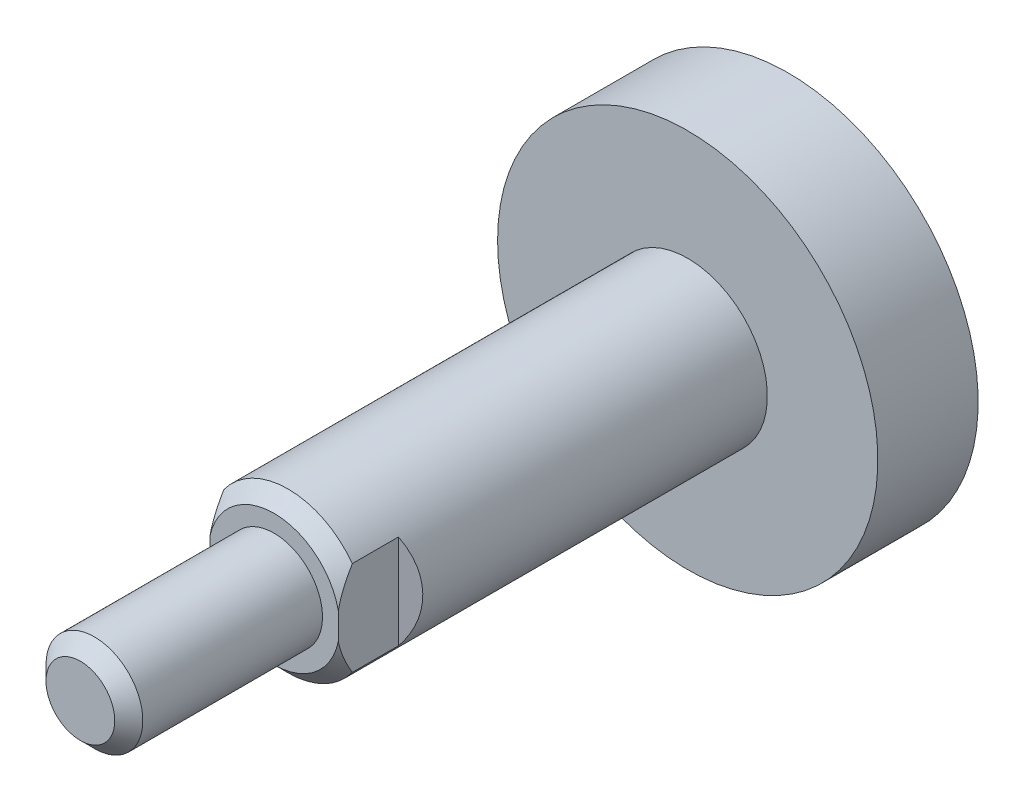
ISO-10303-21;
HEADER;
FILE_DESCRIPTION(('STEP AP214'),'2;1');
FILE_NAME('part.step','',(''),(''),'','','');
FILE_SCHEMA(('AUTOMOTIVE_DESIGN { 1 0 10303 214 1 1 1 1 }'));
ENDSEC;
DATA;
#1=APPLICATION_CONTEXT('core data for automotive mechanical design processes');
#2=APPLICATION_PROTOCOL_DEFINITION('international standard','automotive_design',2000,#1);
#3=PRODUCT_CONTEXT('',#1,'mechanical');
#4=PRODUCT('Part','Part','',(#3));
#5=PRODUCT_RELATED_PRODUCT_CATEGORY('part','',(#4));
#6=PRODUCT_DEFINITION_FORMATION('','',#4);
#7=PRODUCT_DEFINITION_CONTEXT('part definition',#1,'design');
#8=PRODUCT_DEFINITION('design','',#6,#7);
#9=PRODUCT_DEFINITION_SHAPE('','',#8);
#10=(LENGTH_UNIT() NAMED_UNIT(*) SI_UNIT(.MILLI.,.METRE.));
#11=(NAMED_UNIT(*) PLANE_ANGLE_UNIT() SI_UNIT($,.RADIAN.));
#12=(NAMED_UNIT(*) SI_UNIT($,.STERADIAN.) SOLID_ANGLE_UNIT());
#13=UNCERTAINTY_MEASURE_WITH_UNIT(LENGTH_MEASURE(1.E-05),#10,'distance_accuracy_value','');
#14=(GEOMETRIC_REPRESENTATION_CONTEXT(3) GLOBAL_UNCERTAINTY_ASSIGNED_CONTEXT((#13)) GLOBAL_UNIT_ASSIGNED_CONTEXT((#10,
#11,#12)) REPRESENTATION_CONTEXT('',''));
#15=CARTESIAN_POINT('',(0.,0.,0.));
#16=DIRECTION('',(0.,0.,1.));
#17=DIRECTION('',(1.,0.,0.));
#18=AXIS2_PLACEMENT_3D('',#15,#16,#17);
#19=CARTESIAN_POINT('',(0.,0.,35.266));
#20=DIRECTION('',(0.,0.,1.));
#21=DIRECTION('',(1.,0.,0.));
#22=AXIS2_PLACEMENT_3D('',#19,#20,#21);
#23=PLANE('',#22);
#24=CARTESIAN_POINT('',(0.,0.,35.2659999999219));
#25=DIRECTION('',(0.,0.,-1.));
#26=DIRECTION('',(-1.,0.,0.));
#27=AXIS2_PLACEMENT_3D('',#24,#25,#26);
#28=CIRCLE('',#27,1.71299999999519);
#29=CARTESIAN_POINT('',(-1.71299999999519,0.,35.2659999999219));
#30=VERTEX_POINT('',#29);
#31=EDGE_CURVE('E20',#30,#30,#28,.T.);
#32=ORIENTED_EDGE('',*,*,#31,.F.);
#33=EDGE_LOOP('',(#32));
#34=FACE_BOUND('',#33,.T.);
#35=ADVANCED_FACE('F17',(#34),#23,.T.);
#36=CARTESIAN_POINT('',(0.,0.,34.5659999999839));
#37=DIRECTION('',(0.,0.,-1.));
#38=DIRECTION('',(-1.,0.,0.));
#39=AXIS2_PLACEMENT_3D('',#36,#37,#38);
#40=CONICAL_SURFACE('',#39,2.41299999993316,0.785398163397448);
#41=ORIENTED_EDGE('',*,*,#31,.T.);
#42=EDGE_LOOP('',(#41));
#43=FACE_BOUND('',#42,.T.);
#44=CARTESIAN_POINT('',(0.,0.,34.566));
#45=DIRECTION('',(0.,0.,-1.));
#46=DIRECTION('',(-1.,0.,0.));
#47=AXIS2_PLACEMENT_3D('',#44,#45,#46);
#48=CIRCLE('',#47,2.413);
#49=CARTESIAN_POINT('',(-2.413,0.,34.566));
#50=VERTEX_POINT('',#49);
#51=EDGE_CURVE('E72',#50,#50,#48,.T.);
#52=ORIENTED_EDGE('',*,*,#51,.F.);
#53=EDGE_LOOP('',(#52));
#54=FACE_BOUND('',#53,.T.);
#55=ADVANCED_FACE('F197',(#43,#54),#40,.T.);
#56=CARTESIAN_POINT('',(0.,0.,35.266));
#57=DIRECTION('',(0.,0.,-1.));
#58=DIRECTION('',(-1.,0.,0.));
#59=AXIS2_PLACEMENT_3D('',#56,#57,#58);
#60=CYLINDRICAL_SURFACE('',#59,2.413);
#61=ORIENTED_EDGE('',*,*,#51,.T.);
#62=EDGE_LOOP('',(#61));
#63=FACE_BOUND('',#62,.T.);
#64=CARTESIAN_POINT('',(0.,0.,25.614));
#65=DIRECTION('',(0.,0.,-1.));
#66=DIRECTION('',(-1.,0.,0.));
#67=AXIS2_PLACEMENT_3D('',#64,#65,#66);
#68=CIRCLE('',#67,2.413);
#69=CARTESIAN_POINT('',(-2.413,0.,25.614));
#70=VERTEX_POINT('',#69);
#71=EDGE_CURVE('E71',#70,#70,#68,.F.);
#72=ORIENTED_EDGE('',*,*,#71,.T.);
#73=EDGE_LOOP('',(#72));
#74=FACE_BOUND('',#73,.T.);
#75=ADVANCED_FACE('F204',(#63,#74),#60,.T.);
#76=CARTESIAN_POINT('',(0.,0.,25.614));
#77=DIRECTION('',(0.,0.,-1.));
#78=DIRECTION('',(0.,1.,0.));
#79=AXIS2_PLACEMENT_3D('',#76,#77,#78);
#80=PLANE('',#79);
#81=ORIENTED_EDGE('',*,*,#71,.F.);
#82=EDGE_LOOP('',(#81));
#83=FACE_BOUND('',#82,.T.);
#84=DIRECTION('',(0.,1.,0.));
#85=VECTOR('',#84,1.);
#86=CARTESIAN_POINT('',(3.2,0.,25.614));
#87=LINE('',#86,#85);
#88=CARTESIAN_POINT('',(3.2,0.668102537170797,25.6139999999809));
#89=VERTEX_POINT('',#88);
#90=CARTESIAN_POINT('',(3.2,-0.668102537170798,25.6139999999809));
#91=VERTEX_POINT('',#90);
#92=EDGE_CURVE('E59',#89,#91,#87,.F.);
#93=ORIENTED_EDGE('',*,*,#92,.F.);
#94=CARTESIAN_POINT('',(0.,0.,25.6139999999618));
#95=DIRECTION('',(0.,0.,-1.));
#96=DIRECTION('',(0.,1.,0.));
#97=AXIS2_PLACEMENT_3D('',#94,#95,#96);
#98=CIRCLE('',#97,3.26900000004571);
#99=CARTESIAN_POINT('',(-3.2,0.668102537155263,25.6139999999841));
#100=VERTEX_POINT('',#99);
#101=EDGE_CURVE('E92',#100,#89,#98,.T.);
#102=ORIENTED_EDGE('',*,*,#101,.F.);
#103=DIRECTION('',(0.,1.,0.));
#104=VECTOR('',#103,1.);
#105=CARTESIAN_POINT('',(-3.2,-9.475,25.614));
#106=LINE('',#105,#104);
#107=CARTESIAN_POINT('',(-3.2,-0.668102537154732,25.6139999999842));
#108=VERTEX_POINT('',#107);
#109=EDGE_CURVE('E78',#100,#108,#106,.F.);
#110=ORIENTED_EDGE('',*,*,#109,.T.);
#111=CARTESIAN_POINT('',(0.,0.,25.6139999999618));
#112=DIRECTION('',(0.,0.,-1.));
#113=DIRECTION('',(0.,1.,0.));
#114=AXIS2_PLACEMENT_3D('',#111,#112,#113);
#115=CIRCLE('',#114,3.26900000004571);
#116=EDGE_CURVE('E76',#91,#108,#115,.T.);
#117=ORIENTED_EDGE('',*,*,#116,.F.);
#118=EDGE_LOOP('',(#93,#102,#110,#117));
#119=FACE_BOUND('',#118,.T.);
#120=ADVANCED_FACE('F77',(#83,#119),#80,.F.);
#121=CARTESIAN_POINT('',(0.,0.,24.9140000000807));
#122=DIRECTION('',(0.,0.,-1.));
#123=DIRECTION('',(0.,1.,0.));
#124=AXIS2_PLACEMENT_3D('',#121,#122,#123);
#125=CONICAL_SURFACE('',#124,3.96899999998368,0.785398163438051);
#126=CARTESIAN_POINT('',(-3.20000000000324,-0.668102537045559,25.6140000000079));
#127=CARTESIAN_POINT('',(-3.20000000000116,-0.791923989307162,25.5887118948215));
#128=CARTESIAN_POINT('',(-3.20000000000031,-0.914214432197644,25.5569533814339));
#129=CARTESIAN_POINT('',(-3.19999999999969,-1.15522323067472,25.482786734809));
#130=CARTESIAN_POINT('',(-3.19999999999992,-1.27394966585461,25.440405109426));
#131=CARTESIAN_POINT('',(-3.20000000000008,-1.50692397331803,25.3475394481742));
#132=CARTESIAN_POINT('',(-3.20000000000002,-1.62120166838874,25.2971285477279));
#133=CARTESIAN_POINT('',(-3.19999999999998,-1.8466563464418,25.1897204575799));
#134=CARTESIAN_POINT('',(-3.2,-1.95783200288132,25.1327205021669));
#135=CARTESIAN_POINT('',(-3.2,-2.1147772258552,25.047544782855));
#136=CARTESIAN_POINT('',(-3.2,-2.161701362435,25.021462011141));
#137=CARTESIAN_POINT('',(-3.2,-2.25515024754835,24.9683835316909));
#138=CARTESIAN_POINT('',(-3.2,-2.30167405357722,24.9413861634868));
#139=CARTESIAN_POINT('',(-3.2,-2.34796954838271,24.9140000000477));
#140=B_SPLINE_CURVE_WITH_KNOTS('',3,(#126,#127,#128,#129,#130,#131,#132,#133,#134,#135,#136,
#137,#138,#139),.UNSPECIFIED.,.F.,.F.,(4,2,2,2,2,2,4),(0.,0.378663318923574,0.756391005243895,
1.13085654278463,1.50547983437227,1.66653163363144,1.82789340191547),.UNSPECIFIED.);
#141=CARTESIAN_POINT('',(-3.2,-2.3479695483686,24.9140000000238));
#142=VERTEX_POINT('',#141);
#143=EDGE_CURVE('E117',#108,#142,#140,.T.);
#144=ORIENTED_EDGE('',*,*,#143,.T.);
#145=CARTESIAN_POINT('',(0.,0.,24.914));
#146=DIRECTION('',(0.,0.,-1.));
#147=DIRECTION('',(-1.,0.,0.));
#148=AXIS2_PLACEMENT_3D('',#145,#146,#147);
#149=CIRCLE('',#148,3.969);
#150=CARTESIAN_POINT('',(3.2,-2.3479695483686,24.9140000000238));
#151=VERTEX_POINT('',#150);
#152=EDGE_CURVE('E86',#151,#142,#149,.T.);
#153=ORIENTED_EDGE('',*,*,#152,.F.);
#154=CARTESIAN_POINT('',(3.2,-2.34796954838271,24.9140000000477));
#155=CARTESIAN_POINT('',(3.2,-2.28227540638902,24.9528576848915));
#156=CARTESIAN_POINT('',(3.2,-2.21612013329714,24.9909397042438));
#157=CARTESIAN_POINT('',(3.2,-2.08277615458881,25.065293160087));
#158=CARTESIAN_POINT('',(3.2,-2.01558715530726,25.1015640691656));
#159=CARTESIAN_POINT('',(3.2,-1.81330543751406,25.2067462963586));
#160=CARTESIAN_POINT('',(3.2,-1.6765834937986,25.2725768397312));
#161=CARTESIAN_POINT('',(3.2,-1.39788707534561,25.3932563066866));
#162=CARTESIAN_POINT('',(3.2,-1.25590184064602,25.4480810761872));
#163=CARTESIAN_POINT('',(3.2,-0.966123687795267,25.5431571719073));
#164=CARTESIAN_POINT('',(3.2,-0.81829778980787,25.5833066541209));
#165=CARTESIAN_POINT('',(3.2,-0.668102537044839,25.6140000000067));
#166=B_SPLINE_CURVE_WITH_KNOTS('',3,(#154,#155,#156,#157,#158,#159,#160,#161,#162,#163,#164,
#165),.UNSPECIFIED.,.F.,.F.,(4,2,2,2,2,4),(0.,0.228972156487963,0.458010607517393,
0.91289148643811,1.36876002116686,1.82773469580556),.UNSPECIFIED.);
#167=EDGE_CURVE('E64',#151,#91,#166,.T.);
#168=ORIENTED_EDGE('',*,*,#167,.T.);
#169=ORIENTED_EDGE('',*,*,#116,.T.);
#170=EDGE_LOOP('',(#144,#153,#168,#169));
#171=FACE_BOUND('',#170,.T.);
#172=ADVANCED_FACE('F85',(#171),#125,.T.);
#173=CARTESIAN_POINT('',(3.2,-9.475,22.614));
#174=DIRECTION('',(-0.500000000000005,0.,-0.866025403784436));
#175=DIRECTION('',(-0.866025403784436,0.,0.500000000000005));
#176=AXIS2_PLACEMENT_3D('',#173,#174,#175);
#177=PLANE('',#176);
#178=CARTESIAN_POINT('',(0.,0.,24.4615208614068));
#179=DIRECTION('',(-0.500000000000005,0.,-0.866025403784436));
#180=DIRECTION('',(0.866025403784436,0.,-0.500000000000005));
#181=AXIS2_PLACEMENT_3D('',#178,#179,#180);
#182=ELLIPSE('',#181,4.58300643682726,3.969);
#183=CARTESIAN_POINT('',(3.2,2.34796954835449,22.614));
#184=VERTEX_POINT('',#183);
#185=CARTESIAN_POINT('',(3.2,-2.34796954835449,22.614));
#186=VERTEX_POINT('',#185);
#187=EDGE_CURVE('E176',#184,#186,#182,.T.);
#188=ORIENTED_EDGE('',*,*,#187,.F.);
#189=DIRECTION('',(0.,1.,0.));
#190=VECTOR('',#189,1.);
#191=CARTESIAN_POINT('',(3.2,-9.475,22.614));
#192=LINE('',#191,#190);
#193=EDGE_CURVE('E87',#184,#186,#192,.F.);
#194=ORIENTED_EDGE('',*,*,#193,.T.);
#195=EDGE_LOOP('',(#188,#194));
#196=FACE_BOUND('',#195,.T.);
#197=ADVANCED_FACE('F112',(#196),#177,.F.);
#198=CARTESIAN_POINT('',(-3.2,-9.475,22.614));
#199=DIRECTION('',(0.500000000000004,0.,-0.866025403784436));
#200=DIRECTION('',(-0.866025403784436,0.,-0.500000000000004));
#201=AXIS2_PLACEMENT_3D('',#198,#199,#200);
#202=PLANE('',#201);
#203=CARTESIAN_POINT('',(0.,0.,24.4615208614068));
#204=DIRECTION('',(0.500000000000004,0.,-0.866025403784436));
#205=DIRECTION('',(-0.866025403784436,0.,-0.500000000000004));
#206=AXIS2_PLACEMENT_3D('',#203,#204,#205);
#207=ELLIPSE('',#206,4.58300643682726,3.969);
#208=CARTESIAN_POINT('',(-3.2,-2.34796954835449,22.614));
#209=VERTEX_POINT('',#208);
#210=CARTESIAN_POINT('',(-3.2,2.34796954835449,22.614));
#211=VERTEX_POINT('',#210);
#212=EDGE_CURVE('E173',#209,#211,#207,.T.);
#213=ORIENTED_EDGE('',*,*,#212,.F.);
#214=DIRECTION('',(0.,1.,0.));
#215=VECTOR('',#214,1.);
#216=CARTESIAN_POINT('',(-3.2,-9.475,22.614));
#217=LINE('',#216,#215);
#218=EDGE_CURVE('E82',#209,#211,#217,.T.);
#219=ORIENTED_EDGE('',*,*,#218,.T.);
#220=EDGE_LOOP('',(#213,#219));
#221=FACE_BOUND('',#220,.T.);
#222=ADVANCED_FACE('F130',(#221),#202,.F.);
#223=CARTESIAN_POINT('',(-3.2,-9.475,25.614));
#224=DIRECTION('',(1.,0.,0.));
#225=DIRECTION('',(0.,0.,-1.));
#226=AXIS2_PLACEMENT_3D('',#223,#224,#225);
#227=PLANE('',#226);
#228=ORIENTED_EDGE('',*,*,#143,.F.);
#229=ORIENTED_EDGE('',*,*,#109,.F.);
#230=CARTESIAN_POINT('',(-3.19999999998987,2.34796954838807,24.9140000000384));
#231=CARTESIAN_POINT('',(-3.19999999999627,2.28227540639574,24.9528576848853));
#232=CARTESIAN_POINT('',(-3.19999999999898,2.21612013330425,24.9909397042391));
#233=CARTESIAN_POINT('',(-3.20000000000102,2.08277615459583,25.0652931600838));
#234=CARTESIAN_POINT('',(-3.20000000000036,2.01558715531381,25.1015640691624));
#235=CARTESIAN_POINT('',(-3.19999999999929,1.81330543751945,25.2067462963555));
#236=CARTESIAN_POINT('',(-3.1999999999998,1.67658349380355,25.2725768397288));
#237=CARTESIAN_POINT('',(-3.2000000000002,1.39788707534955,25.3932563066852));
#238=CARTESIAN_POINT('',(-3.2000000000001,1.2559018406494,25.4480810761861));
#239=CARTESIAN_POINT('',(-3.1999999999999,0.966123687797418,25.5431571719066));
#240=CARTESIAN_POINT('',(-3.19999999999979,0.818297789809342,25.5833066541205));
#241=CARTESIAN_POINT('',(-3.2,0.668102537045687,25.6140000000065));
#242=B_SPLINE_CURVE_WITH_KNOTS('',3,(#230,#231,#232,#233,#234,#235,#236,#237,#238,#239,#240,
#241),.UNSPECIFIED.,.F.,.F.,(4,2,2,2,2,4),(0.,0.228972156489184,0.458010607519769,
0.912891486442607,1.3687600211732,1.82773469581398),.UNSPECIFIED.);
#243=CARTESIAN_POINT('',(-3.2,2.34796954835449,24.9140000000322));
#244=VERTEX_POINT('',#243);
#245=EDGE_CURVE('E122',#244,#100,#242,.T.);
#246=ORIENTED_EDGE('',*,*,#245,.F.);
#247=DIRECTION('',(0.,0.,-1.));
#248=VECTOR('',#247,1.);
#249=CARTESIAN_POINT('',(-3.2,2.34796954835449,36.8400272581176));
#250=LINE('',#249,#248);
#251=EDGE_CURVE('E175',#211,#244,#250,.F.);
#252=ORIENTED_EDGE('',*,*,#251,.F.);
#253=ORIENTED_EDGE('',*,*,#218,.F.);
#254=DIRECTION('',(0.,0.,-1.));
#255=VECTOR('',#254,1.);
#256=CARTESIAN_POINT('',(-3.2,-2.34796954835449,36.8400272581176));
#257=LINE('',#256,#255);
#258=EDGE_CURVE('E178',#142,#209,#257,.T.);
#259=ORIENTED_EDGE('',*,*,#258,.F.);
#260=EDGE_LOOP('',(#228,#229,#246,#252,#253,#259));
#261=FACE_BOUND('',#260,.T.);
#262=ADVANCED_FACE('F126',(#261),#227,.F.);
#263=CARTESIAN_POINT('',(0.,0.,24.9140000000807));
#264=DIRECTION('',(0.,0.,-1.));
#265=DIRECTION('',(0.,1.,0.));
#266=AXIS2_PLACEMENT_3D('',#263,#264,#265);
#267=CONICAL_SURFACE('',#266,3.96899999998368,0.785398163438051);
#268=ORIENTED_EDGE('',*,*,#245,.T.);
#269=ORIENTED_EDGE('',*,*,#101,.T.);
#270=CARTESIAN_POINT('',(3.20000000000325,0.668102537045564,25.6140000000079));
#271=CARTESIAN_POINT('',(3.20000000000117,0.791923989307168,25.5887118948215));
#272=CARTESIAN_POINT('',(3.20000000000031,0.914214432197651,25.5569533814339));
#273=CARTESIAN_POINT('',(3.19999999999969,1.15522323067473,25.482786734809));
#274=CARTESIAN_POINT('',(3.19999999999992,1.27394966585462,25.440405109426));
#275=CARTESIAN_POINT('',(3.20000000000008,1.50692397331804,25.3475394481742));
#276=CARTESIAN_POINT('',(3.20000000000003,1.62120166838875,25.2971285477279));
#277=CARTESIAN_POINT('',(3.19999999999998,1.84665634644181,25.1897204575799));
#278=CARTESIAN_POINT('',(3.2,1.95783200288133,25.1327205021669));
#279=CARTESIAN_POINT('',(3.20000000000001,2.11477722585521,25.0475447828549));
#280=CARTESIAN_POINT('',(3.2,2.161701362435,25.021462011141));
#281=CARTESIAN_POINT('',(3.2,2.25515024754835,24.9683835316909));
#282=CARTESIAN_POINT('',(3.2,2.30167405357722,24.9413861634868));
#283=CARTESIAN_POINT('',(3.2,2.34796954838271,24.9140000000477));
#284=B_SPLINE_CURVE_WITH_KNOTS('',3,(#270,#271,#272,#273,#274,#275,#276,#277,#278,#279,#280,
#281,#282,#283),.UNSPECIFIED.,.F.,.F.,(4,2,2,2,2,2,4),(0.,0.378663318923575,0.756391005243901,
1.13085654278463,1.50547983437227,1.66653163363144,1.82789340191546),.UNSPECIFIED.);
#285=CARTESIAN_POINT('',(3.2,2.3479695483686,24.9140000000238));
#286=VERTEX_POINT('',#285);
#287=EDGE_CURVE('E67',#89,#286,#284,.T.);
#288=ORIENTED_EDGE('',*,*,#287,.T.);
#289=CARTESIAN_POINT('',(0.,0.,24.914));
#290=DIRECTION('',(0.,0.,-1.));
#291=DIRECTION('',(-1.,0.,0.));
#292=AXIS2_PLACEMENT_3D('',#289,#290,#291);
#293=CIRCLE('',#292,3.969);
#294=EDGE_CURVE('E35',#244,#286,#293,.T.);
#295=ORIENTED_EDGE('',*,*,#294,.F.);
#296=EDGE_LOOP('',(#268,#269,#288,#295));
#297=FACE_BOUND('',#296,.T.);
#298=ADVANCED_FACE('F129',(#297),#267,.T.);
#299=CARTESIAN_POINT('',(3.2,-9.475,25.614));
#300=DIRECTION('',(-1.,0.,0.));
#301=DIRECTION('',(0.,0.,1.));
#302=AXIS2_PLACEMENT_3D('',#299,#300,#301);
#303=PLANE('',#302);
#304=ORIENTED_EDGE('',*,*,#287,.F.);
#305=ORIENTED_EDGE('',*,*,#92,.T.);
#306=ORIENTED_EDGE('',*,*,#167,.F.);
#307=DIRECTION('',(0.,0.,-1.));
#308=VECTOR('',#307,1.);
#309=CARTESIAN_POINT('',(3.20000000000001,-2.34796954835449,36.8400272581176));
#310=LINE('',#309,#308);
#311=EDGE_CURVE('E89',#186,#151,#310,.F.);
#312=ORIENTED_EDGE('',*,*,#311,.F.);
#313=ORIENTED_EDGE('',*,*,#193,.F.);
#314=DIRECTION('',(0.,0.,-1.));
#315=VECTOR('',#314,1.);
#316=CARTESIAN_POINT('',(3.2,2.34796954835449,36.8400272581176));
#317=LINE('',#316,#315);
#318=EDGE_CURVE('E167',#286,#184,#317,.T.);
#319=ORIENTED_EDGE('',*,*,#318,.F.);
#320=EDGE_LOOP('',(#304,#305,#306,#312,#313,#319));
#321=FACE_BOUND('',#320,.T.);
#322=ADVANCED_FACE('F61',(#321),#303,.F.);
#323=CARTESIAN_POINT('',(0.,0.,36.8400272581176));
#324=DIRECTION('',(0.,0.,-1.));
#325=DIRECTION('',(-1.,0.,0.));
#326=AXIS2_PLACEMENT_3D('',#323,#324,#325);
#327=CYLINDRICAL_SURFACE('',#326,3.969);
#328=CARTESIAN_POINT('',(0.,0.,5.));
#329=DIRECTION('',(0.,0.,-1.));
#330=DIRECTION('',(-1.,0.,0.));
#331=AXIS2_PLACEMENT_3D('',#328,#329,#330);
#332=CIRCLE('',#331,3.969);
#333=CARTESIAN_POINT('',(-3.969,0.,5.));
#334=VERTEX_POINT('',#333);
#335=EDGE_CURVE('E165',#334,#334,#332,.T.);
#336=ORIENTED_EDGE('',*,*,#335,.F.);
#337=EDGE_LOOP('',(#336));
#338=FACE_BOUND('',#337,.T.);
#339=ORIENTED_EDGE('',*,*,#294,.T.);
#340=ORIENTED_EDGE('',*,*,#318,.T.);
#341=ORIENTED_EDGE('',*,*,#187,.T.);
#342=ORIENTED_EDGE('',*,*,#311,.T.);
#343=ORIENTED_EDGE('',*,*,#152,.T.);
#344=ORIENTED_EDGE('',*,*,#258,.T.);
#345=ORIENTED_EDGE('',*,*,#212,.T.);
#346=ORIENTED_EDGE('',*,*,#251,.T.);
#347=EDGE_LOOP('',(#339,#340,#341,#342,#343,#344,#345,#346));
#348=FACE_BOUND('',#347,.T.);
#349=ADVANCED_FACE('F156',(#338,#348),#327,.T.);
#350=CARTESIAN_POINT('',(0.,0.,5.));
#351=DIRECTION('',(0.,0.,1.));
#352=DIRECTION('',(1.,0.,0.));
#353=AXIS2_PLACEMENT_3D('',#350,#351,#352);
#354=PLANE('',#353);
#355=CARTESIAN_POINT('',(0.,0.,5.));
#356=DIRECTION('',(0.,0.,-1.));
#357=DIRECTION('',(-1.,0.,0.));
#358=AXIS2_PLACEMENT_3D('',#355,#356,#357);
#359=CIRCLE('',#358,9.475);
#360=CARTESIAN_POINT('',(-9.475,0.,5.));
#361=VERTEX_POINT('',#360);
#362=EDGE_CURVE('E26',#361,#361,#359,.T.);
#363=ORIENTED_EDGE('',*,*,#362,.F.);
#364=EDGE_LOOP('',(#363));
#365=FACE_BOUND('',#364,.T.);
#366=ORIENTED_EDGE('',*,*,#335,.T.);
#367=EDGE_LOOP('',(#366));
#368=FACE_BOUND('',#367,.T.);
#369=ADVANCED_FACE('F150',(#365,#368),#354,.T.);
#370=CARTESIAN_POINT('',(0.,0.,5.));
#371=DIRECTION('',(0.,0.,-1.));
#372=DIRECTION('',(-1.,0.,0.));
#373=AXIS2_PLACEMENT_3D('',#370,#371,#372);
#374=CYLINDRICAL_SURFACE('',#373,9.475);
#375=ORIENTED_EDGE('',*,*,#362,.T.);
#376=EDGE_LOOP('',(#375));
#377=FACE_BOUND('',#376,.T.);
#378=CARTESIAN_POINT('',(0.,0.,0.));
#379=DIRECTION('',(0.,0.,-1.));
#380=DIRECTION('',(-1.,0.,0.));
#381=AXIS2_PLACEMENT_3D('',#378,#379,#380);
#382=CIRCLE('',#381,9.475);
#383=CARTESIAN_POINT('',(-9.475,0.,0.));
#384=VERTEX_POINT('',#383);
#385=EDGE_CURVE('E11',#384,#384,#382,.F.);
#386=ORIENTED_EDGE('',*,*,#385,.T.);
#387=EDGE_LOOP('',(#386));
#388=FACE_BOUND('',#387,.T.);
#389=ADVANCED_FACE('F144',(#377,#388),#374,.T.);
#390=CARTESIAN_POINT('',(0.,0.,0.));
#391=DIRECTION('',(0.,0.,1.));
#392=DIRECTION('',(1.,0.,0.));
#393=AXIS2_PLACEMENT_3D('',#390,#391,#392);
#394=PLANE('',#393);
#395=ORIENTED_EDGE('',*,*,#385,.F.);
#396=EDGE_LOOP('',(#395));
#397=FACE_BOUND('',#396,.T.);
#398=ADVANCED_FACE('F142',(#397),#394,.F.);
#399=CLOSED_SHELL('',(#35,#55,#75,#120,#172,#197,#222,#262,#298,#322,#349,#369,#389,#398));
#400=MANIFOLD_SOLID_BREP('B1',#399);
#401=ADVANCED_BREP_SHAPE_REPRESENTATION('',(#18,#400),#14);
#402=SHAPE_DEFINITION_REPRESENTATION(#9,#401);
ENDSEC;
END-ISO-10303-21;
